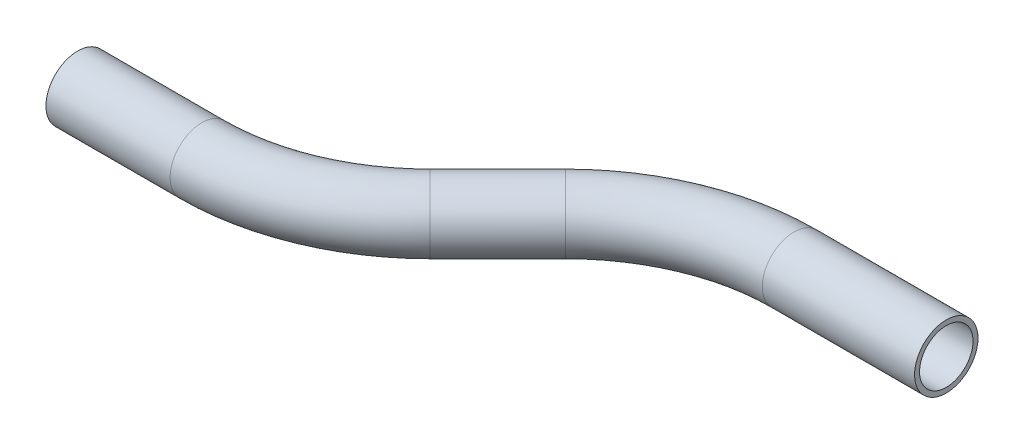
ISO-10303-21;
HEADER;
FILE_DESCRIPTION(('STEP AP214'),'2;1');
FILE_NAME('part.step','',(''),(''),'','','');
FILE_SCHEMA(('AUTOMOTIVE_DESIGN { 1 0 10303 214 1 1 1 1 }'));
ENDSEC;
DATA;
#1=APPLICATION_CONTEXT('core data for automotive mechanical design processes');
#2=APPLICATION_PROTOCOL_DEFINITION('international standard','automotive_design',2000,#1);
#3=PRODUCT_CONTEXT('',#1,'mechanical');
#4=PRODUCT('Part','Part','',(#3));
#5=PRODUCT_RELATED_PRODUCT_CATEGORY('part','',(#4));
#6=PRODUCT_DEFINITION_FORMATION('','',#4);
#7=PRODUCT_DEFINITION_CONTEXT('part definition',#1,'design');
#8=PRODUCT_DEFINITION('design','',#6,#7);
#9=PRODUCT_DEFINITION_SHAPE('','',#8);
#10=(LENGTH_UNIT() NAMED_UNIT(*) SI_UNIT(.MILLI.,.METRE.));
#11=(NAMED_UNIT(*) PLANE_ANGLE_UNIT() SI_UNIT($,.RADIAN.));
#12=(NAMED_UNIT(*) SI_UNIT($,.STERADIAN.) SOLID_ANGLE_UNIT());
#13=UNCERTAINTY_MEASURE_WITH_UNIT(LENGTH_MEASURE(1.E-05),#10,'distance_accuracy_value','');
#14=(GEOMETRIC_REPRESENTATION_CONTEXT(3) GLOBAL_UNCERTAINTY_ASSIGNED_CONTEXT((#13)) GLOBAL_UNIT_ASSIGNED_CONTEXT((#10,
#11,#12)) REPRESENTATION_CONTEXT('',''));
#15=CARTESIAN_POINT('',(0.,0.,0.));
#16=DIRECTION('',(0.,0.,1.));
#17=DIRECTION('',(1.,0.,0.));
#18=AXIS2_PLACEMENT_3D('',#15,#16,#17);
#19=CARTESIAN_POINT('',(0.,0.,0.));
#20=DIRECTION('',(1.,0.,0.));
#21=DIRECTION('',(0.,0.,-1.));
#22=AXIS2_PLACEMENT_3D('',#19,#20,#21);
#23=CYLINDRICAL_SURFACE('',#22,7.9375);
#24=CARTESIAN_POINT('',(31.0663525143775,0.,0.));
#25=DIRECTION('',(1.,0.,0.));
#26=DIRECTION('',(0.,0.,-1.));
#27=AXIS2_PLACEMENT_3D('',#24,#25,#26);
#28=CIRCLE('',#27,7.9375);
#29=CARTESIAN_POINT('',(31.0663525143775,0.,7.93749999999997));
#30=VERTEX_POINT('',#29);
#31=EDGE_CURVE('E57',#30,#30,#28,.T.);
#32=ORIENTED_EDGE('',*,*,#31,.F.);
#33=EDGE_LOOP('',(#32));
#34=FACE_BOUND('',#33,.T.);
#35=CARTESIAN_POINT('',(0.,0.,0.));
#36=DIRECTION('',(1.,0.,0.));
#37=DIRECTION('',(0.,0.,-1.));
#38=AXIS2_PLACEMENT_3D('',#35,#36,#37);
#39=CIRCLE('',#38,7.9375);
#40=CARTESIAN_POINT('',(0.,0.,-7.9375));
#41=VERTEX_POINT('',#40);
#42=EDGE_CURVE('E54',#41,#41,#39,.T.);
#43=ORIENTED_EDGE('',*,*,#42,.T.);
#44=EDGE_LOOP('',(#43));
#45=FACE_BOUND('',#44,.T.);
#46=ADVANCED_FACE('F33',(#34,#45),#23,.T.);
#47=CARTESIAN_POINT('',(31.0663525143775,0.,-57.15));
#48=DIRECTION('',(0.,1.,0.));
#49=DIRECTION('',(0.,0.,1.));
#50=AXIS2_PLACEMENT_3D('',#47,#48,#49);
#51=TOROIDAL_SURFACE('',#50,57.15,7.9375);
#52=CARTESIAN_POINT('',(71.4775050591888,0.,-16.7388474551889));
#53=DIRECTION('',(0.707106781186546,0.,-0.707106781186549));
#54=DIRECTION('',(-0.707106781186549,0.,-0.707106781186546));
#55=AXIS2_PLACEMENT_3D('',#52,#53,#54);
#56=CIRCLE('',#55,7.9375);
#57=CARTESIAN_POINT('',(77.090165134857,0.,-11.1261873795207));
#58=VERTEX_POINT('',#57);
#59=EDGE_CURVE('E60',#58,#58,#56,.T.);
#60=CARTESIAN_POINT('',(31.0663525143775,0.,-57.15));
#61=DIRECTION('',(0.,1.,0.));
#62=DIRECTION('',(0.,0.,1.));
#63=AXIS2_PLACEMENT_3D('',#60,#61,#62);
#64=CIRCLE('',#63,65.0875);
#65=EDGE_CURVE('',#30,#58,#64,.T.);
#66=ORIENTED_EDGE('',*,*,#31,.T.);
#67=ORIENTED_EDGE('',*,*,#59,.F.);
#68=ORIENTED_EDGE('',*,*,#65,.T.);
#69=ORIENTED_EDGE('',*,*,#65,.F.);
#70=EDGE_LOOP('',(#66,#68,#67,#69));
#71=FACE_BOUND('',#70,.T.);
#72=ADVANCED_FACE('F79',(#71),#51,.T.);
#73=CARTESIAN_POINT('',(71.4775050591888,0.,-16.7388474551889));
#74=DIRECTION('',(0.707106781186547,0.,-0.707106781186548));
#75=DIRECTION('',(-0.707106781186548,0.,-0.707106781186547));
#76=AXIS2_PLACEMENT_3D('',#73,#74,#75);
#77=CYLINDRICAL_SURFACE('',#76,7.9375);
#78=CARTESIAN_POINT('',(88.415939948811,0.,-33.6772823448111));
#79=DIRECTION('',(0.707106781186547,0.,-0.707106781186548));
#80=DIRECTION('',(-0.707106781186548,0.,-0.707106781186547));
#81=AXIS2_PLACEMENT_3D('',#78,#79,#80);
#82=CIRCLE('',#81,7.9375);
#83=CARTESIAN_POINT('',(82.8032798731427,0.,-39.2899424204793));
#84=VERTEX_POINT('',#83);
#85=EDGE_CURVE('E62',#84,#84,#82,.T.);
#86=ORIENTED_EDGE('',*,*,#85,.F.);
#87=EDGE_LOOP('',(#86));
#88=FACE_BOUND('',#87,.T.);
#89=ORIENTED_EDGE('',*,*,#59,.T.);
#90=EDGE_LOOP('',(#89));
#91=FACE_BOUND('',#90,.T.);
#92=ADVANCED_FACE('F72',(#88,#91),#77,.T.);
#93=CARTESIAN_POINT('',(128.827092493622,0.,6.7338702));
#94=DIRECTION('',(0.,-1.,0.));
#95=DIRECTION('',(0.,0.,-1.));
#96=AXIS2_PLACEMENT_3D('',#93,#94,#95);
#97=TOROIDAL_SURFACE('',#96,57.15,7.9375);
#98=CARTESIAN_POINT('',(128.827092493622,0.,-50.4161298));
#99=DIRECTION('',(1.,0.,0.));
#100=DIRECTION('',(0.,0.,-1.));
#101=AXIS2_PLACEMENT_3D('',#98,#99,#100);
#102=CIRCLE('',#101,7.9375);
#103=CARTESIAN_POINT('',(128.827092493622,0.,-58.3536298));
#104=VERTEX_POINT('',#103);
#105=EDGE_CURVE('E37',#104,#104,#102,.T.);
#106=CARTESIAN_POINT('',(128.827092493622,0.,6.7338702));
#107=DIRECTION('',(0.,-1.,0.));
#108=DIRECTION('',(0.,0.,-1.));
#109=AXIS2_PLACEMENT_3D('',#106,#107,#108);
#110=CIRCLE('',#109,65.0875);
#111=EDGE_CURVE('',#84,#104,#110,.T.);
#112=ORIENTED_EDGE('',*,*,#85,.T.);
#113=ORIENTED_EDGE('',*,*,#105,.F.);
#114=ORIENTED_EDGE('',*,*,#111,.T.);
#115=ORIENTED_EDGE('',*,*,#111,.F.);
#116=EDGE_LOOP('',(#112,#114,#113,#115));
#117=FACE_BOUND('',#116,.T.);
#118=ADVANCED_FACE('F70',(#117),#97,.T.);
#119=CARTESIAN_POINT('',(128.827092493622,0.,-50.4161298));
#120=DIRECTION('',(1.,0.,0.));
#121=DIRECTION('',(0.,0.,-1.));
#122=AXIS2_PLACEMENT_3D('',#119,#120,#121);
#123=CYLINDRICAL_SURFACE('',#122,7.9375);
#124=CARTESIAN_POINT('',(166.927092493622,0.,-50.4161298));
#125=DIRECTION('',(1.,0.,0.));
#126=DIRECTION('',(0.,0.,-1.));
#127=AXIS2_PLACEMENT_3D('',#124,#125,#126);
#128=CIRCLE('',#127,7.9375);
#129=CARTESIAN_POINT('',(166.927092493622,0.,-58.3536298));
#130=VERTEX_POINT('',#129);
#131=EDGE_CURVE('E50',#130,#130,#128,.T.);
#132=ORIENTED_EDGE('',*,*,#131,.F.);
#133=EDGE_LOOP('',(#132));
#134=FACE_BOUND('',#133,.T.);
#135=ORIENTED_EDGE('',*,*,#105,.T.);
#136=EDGE_LOOP('',(#135));
#137=FACE_BOUND('',#136,.T.);
#138=ADVANCED_FACE('F35',(#134,#137),#123,.T.);
#139=CARTESIAN_POINT('',(0.,0.,0.));
#140=DIRECTION('',(1.,0.,0.));
#141=DIRECTION('',(0.,0.,-1.));
#142=AXIS2_PLACEMENT_3D('',#139,#140,#141);
#143=PLANE('',#142);
#144=CARTESIAN_POINT('',(0.,0.,0.));
#145=DIRECTION('',(1.,0.,0.));
#146=DIRECTION('',(0.,0.,-1.));
#147=AXIS2_PLACEMENT_3D('',#144,#145,#146);
#148=CIRCLE('',#147,6.6929);
#149=CARTESIAN_POINT('',(0.,0.,-6.6929));
#150=VERTEX_POINT('',#149);
#151=EDGE_CURVE('E53',#150,#150,#148,.F.);
#152=ORIENTED_EDGE('',*,*,#151,.F.);
#153=EDGE_LOOP('',(#152));
#154=FACE_BOUND('',#153,.T.);
#155=ORIENTED_EDGE('',*,*,#42,.F.);
#156=EDGE_LOOP('',(#155));
#157=FACE_BOUND('',#156,.T.);
#158=ADVANCED_FACE('F77',(#154,#157),#143,.F.);
#159=CARTESIAN_POINT('',(166.927092493622,0.,-50.4161298));
#160=DIRECTION('',(1.,0.,0.));
#161=DIRECTION('',(0.,0.,-1.));
#162=AXIS2_PLACEMENT_3D('',#159,#160,#161);
#163=PLANE('',#162);
#164=CARTESIAN_POINT('',(166.927092493622,0.,-50.4161298));
#165=DIRECTION('',(1.,0.,0.));
#166=DIRECTION('',(0.,0.,-1.));
#167=AXIS2_PLACEMENT_3D('',#164,#165,#166);
#168=CIRCLE('',#167,6.6929);
#169=CARTESIAN_POINT('',(166.927092493622,0.,-57.1090298));
#170=VERTEX_POINT('',#169);
#171=EDGE_CURVE('E10',#170,#170,#168,.F.);
#172=ORIENTED_EDGE('',*,*,#171,.T.);
#173=EDGE_LOOP('',(#172));
#174=FACE_BOUND('',#173,.T.);
#175=ORIENTED_EDGE('',*,*,#131,.T.);
#176=EDGE_LOOP('',(#175));
#177=FACE_BOUND('',#176,.T.);
#178=ADVANCED_FACE('F96',(#174,#177),#163,.T.);
#179=CARTESIAN_POINT('',(0.,0.,0.));
#180=DIRECTION('',(1.,0.,0.));
#181=DIRECTION('',(0.,0.,-1.));
#182=AXIS2_PLACEMENT_3D('',#179,#180,#181);
#183=CYLINDRICAL_SURFACE('',#182,6.6929);
#184=CARTESIAN_POINT('',(31.0663525143775,0.,0.));
#185=DIRECTION('',(1.,0.,0.));
#186=DIRECTION('',(0.,0.,-1.));
#187=AXIS2_PLACEMENT_3D('',#184,#185,#186);
#188=CIRCLE('',#187,6.6929);
#189=CARTESIAN_POINT('',(31.0663525143775,0.,6.69289999999997));
#190=VERTEX_POINT('',#189);
#191=EDGE_CURVE('E192',#190,#190,#188,.F.);
#192=ORIENTED_EDGE('',*,*,#191,.F.);
#193=EDGE_LOOP('',(#192));
#194=FACE_BOUND('',#193,.T.);
#195=ORIENTED_EDGE('',*,*,#151,.T.);
#196=EDGE_LOOP('',(#195));
#197=FACE_BOUND('',#196,.T.);
#198=ADVANCED_FACE('F99',(#194,#197),#183,.F.);
#199=CARTESIAN_POINT('',(31.0663525143775,0.,-57.15));
#200=DIRECTION('',(0.,1.,0.));
#201=DIRECTION('',(0.,0.,1.));
#202=AXIS2_PLACEMENT_3D('',#199,#200,#201);
#203=TOROIDAL_SURFACE('',#202,57.15,6.6929);
#204=CARTESIAN_POINT('',(71.4775050591888,0.,-16.7388474551889));
#205=DIRECTION('',(0.707106781186546,0.,-0.707106781186549));
#206=DIRECTION('',(-0.707106781186549,0.,-0.707106781186546));
#207=AXIS2_PLACEMENT_3D('',#204,#205,#206);
#208=CIRCLE('',#207,6.6929);
#209=CARTESIAN_POINT('',(76.2101000349923,0.,-12.0062524793855));
#210=VERTEX_POINT('',#209);
#211=EDGE_CURVE('E191',#210,#210,#208,.F.);
#212=CARTESIAN_POINT('',(31.0663525143775,0.,-57.15));
#213=DIRECTION('',(0.,1.,0.));
#214=DIRECTION('',(0.,0.,1.));
#215=AXIS2_PLACEMENT_3D('',#212,#213,#214);
#216=CIRCLE('',#215,63.8429);
#217=EDGE_CURVE('',#190,#210,#216,.T.);
#218=ORIENTED_EDGE('',*,*,#191,.T.);
#219=ORIENTED_EDGE('',*,*,#211,.F.);
#220=ORIENTED_EDGE('',*,*,#217,.T.);
#221=ORIENTED_EDGE('',*,*,#217,.F.);
#222=EDGE_LOOP('',(#218,#220,#219,#221));
#223=FACE_BOUND('',#222,.T.);
#224=ADVANCED_FACE('F154',(#223),#203,.F.);
#225=CARTESIAN_POINT('',(71.4775050591888,0.,-16.7388474551889));
#226=DIRECTION('',(0.707106781186547,0.,-0.707106781186548));
#227=DIRECTION('',(-0.707106781186548,0.,-0.707106781186547));
#228=AXIS2_PLACEMENT_3D('',#225,#226,#227);
#229=CYLINDRICAL_SURFACE('',#228,6.6929);
#230=CARTESIAN_POINT('',(88.415939948811,0.,-33.6772823448111));
#231=DIRECTION('',(0.707106781186547,0.,-0.707106781186548));
#232=DIRECTION('',(-0.707106781186548,0.,-0.707106781186547));
#233=AXIS2_PLACEMENT_3D('',#230,#231,#232);
#234=CIRCLE('',#233,6.6929);
#235=CARTESIAN_POINT('',(83.6833449730075,0.,-38.4098773206145));
#236=VERTEX_POINT('',#235);
#237=EDGE_CURVE('E46',#236,#236,#234,.F.);
#238=ORIENTED_EDGE('',*,*,#237,.F.);
#239=EDGE_LOOP('',(#238));
#240=FACE_BOUND('',#239,.T.);
#241=ORIENTED_EDGE('',*,*,#211,.T.);
#242=EDGE_LOOP('',(#241));
#243=FACE_BOUND('',#242,.T.);
#244=ADVANCED_FACE('F90',(#240,#243),#229,.F.);
#245=CARTESIAN_POINT('',(128.827092493622,0.,6.7338702));
#246=DIRECTION('',(0.,-1.,0.));
#247=DIRECTION('',(0.,0.,-1.));
#248=AXIS2_PLACEMENT_3D('',#245,#246,#247);
#249=TOROIDAL_SURFACE('',#248,57.15,6.6929);
#250=CARTESIAN_POINT('',(128.827092493622,0.,-50.4161298));
#251=DIRECTION('',(1.,0.,0.));
#252=DIRECTION('',(0.,0.,-1.));
#253=AXIS2_PLACEMENT_3D('',#250,#251,#252);
#254=CIRCLE('',#253,6.6929);
#255=CARTESIAN_POINT('',(128.827092493622,0.,-57.1090298));
#256=VERTEX_POINT('',#255);
#257=EDGE_CURVE('E41',#256,#256,#254,.F.);
#258=CARTESIAN_POINT('',(128.827092493622,0.,6.7338702));
#259=DIRECTION('',(0.,-1.,0.));
#260=DIRECTION('',(0.,0.,-1.));
#261=AXIS2_PLACEMENT_3D('',#258,#259,#260);
#262=CIRCLE('',#261,63.8429);
#263=EDGE_CURVE('',#236,#256,#262,.T.);
#264=ORIENTED_EDGE('',*,*,#237,.T.);
#265=ORIENTED_EDGE('',*,*,#257,.F.);
#266=ORIENTED_EDGE('',*,*,#263,.T.);
#267=ORIENTED_EDGE('',*,*,#263,.F.);
#268=EDGE_LOOP('',(#264,#266,#265,#267));
#269=FACE_BOUND('',#268,.T.);
#270=ADVANCED_FACE('F84',(#269),#249,.F.);
#271=CARTESIAN_POINT('',(128.827092493622,0.,-50.4161298));
#272=DIRECTION('',(1.,0.,0.));
#273=DIRECTION('',(0.,0.,-1.));
#274=AXIS2_PLACEMENT_3D('',#271,#272,#273);
#275=CYLINDRICAL_SURFACE('',#274,6.6929);
#276=ORIENTED_EDGE('',*,*,#171,.F.);
#277=EDGE_LOOP('',(#276));
#278=FACE_BOUND('',#277,.T.);
#279=ORIENTED_EDGE('',*,*,#257,.T.);
#280=EDGE_LOOP('',(#279));
#281=FACE_BOUND('',#280,.T.);
#282=ADVANCED_FACE('F82',(#278,#281),#275,.F.);
#283=CLOSED_SHELL('',(#46,#72,#92,#118,#138,#158,#178,#198,#224,#244,#270,#282));
#284=MANIFOLD_SOLID_BREP('B2',#283);
#285=ADVANCED_BREP_SHAPE_REPRESENTATION('',(#18,#284),#14);
#286=SHAPE_DEFINITION_REPRESENTATION(#9,#285);
ENDSEC;
END-ISO-10303-21;
